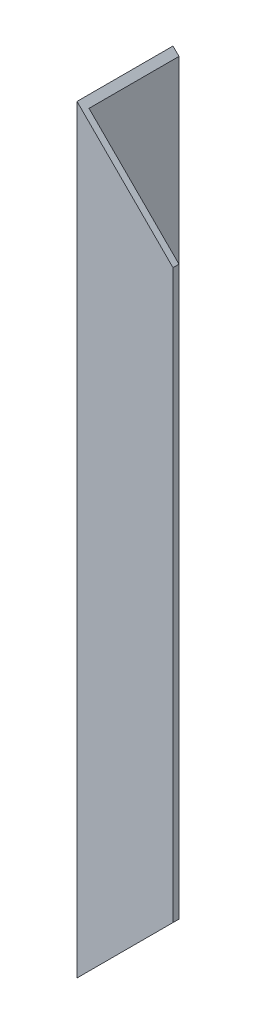
ISO-10303-21;
HEADER;
FILE_DESCRIPTION(('STEP AP214'),'2;1');
FILE_NAME('part.step','',(''),(''),'','','');
FILE_SCHEMA(('AUTOMOTIVE_DESIGN { 1 0 10303 214 1 1 1 1 }'));
ENDSEC;
DATA;
#1=APPLICATION_CONTEXT('core data for automotive mechanical design processes');
#2=APPLICATION_PROTOCOL_DEFINITION('international standard','automotive_design',2000,#1);
#3=PRODUCT_CONTEXT('',#1,'mechanical');
#4=PRODUCT('Part','Part','',(#3));
#5=PRODUCT_RELATED_PRODUCT_CATEGORY('part','',(#4));
#6=PRODUCT_DEFINITION_FORMATION('','',#4);
#7=PRODUCT_DEFINITION_CONTEXT('part definition',#1,'design');
#8=PRODUCT_DEFINITION('design','',#6,#7);
#9=PRODUCT_DEFINITION_SHAPE('','',#8);
#10=(LENGTH_UNIT() NAMED_UNIT(*) SI_UNIT(.MILLI.,.METRE.));
#11=(NAMED_UNIT(*) PLANE_ANGLE_UNIT() SI_UNIT($,.RADIAN.));
#12=(NAMED_UNIT(*) SI_UNIT($,.STERADIAN.) SOLID_ANGLE_UNIT());
#13=UNCERTAINTY_MEASURE_WITH_UNIT(LENGTH_MEASURE(1.E-05),#10,'distance_accuracy_value','');
#14=(GEOMETRIC_REPRESENTATION_CONTEXT(3) GLOBAL_UNCERTAINTY_ASSIGNED_CONTEXT((#13)) GLOBAL_UNIT_ASSIGNED_CONTEXT((#10,
#11,#12)) REPRESENTATION_CONTEXT('',''));
#15=CARTESIAN_POINT('',(0.,0.,0.));
#16=DIRECTION('',(0.,0.,1.));
#17=DIRECTION('',(1.,0.,0.));
#18=AXIS2_PLACEMENT_3D('',#15,#16,#17);
#19=CARTESIAN_POINT('',(25.4,200.914,0.));
#20=DIRECTION('',(0.,0.,-1.));
#21=DIRECTION('',(-1.,0.,0.));
#22=AXIS2_PLACEMENT_3D('',#19,#20,#21);
#23=PLANE('',#22);
#24=DIRECTION('',(0.,-1.,0.));
#25=VECTOR('',#24,1.);
#26=CARTESIAN_POINT('',(0.,200.914,0.));
#27=LINE('',#26,#25);
#28=CARTESIAN_POINT('',(0.,200.914,0.));
#29=VERTEX_POINT('',#28);
#30=CARTESIAN_POINT('',(0.,0.,0.));
#31=VERTEX_POINT('',#30);
#32=EDGE_CURVE('E106',#29,#31,#27,.T.);
#33=ORIENTED_EDGE('',*,*,#32,.T.);
#34=DIRECTION('',(-0.707106781186551,-0.707106781186544,0.));
#35=VECTOR('',#34,1.);
#36=CARTESIAN_POINT('',(0.,0.,0.));
#37=LINE('',#36,#35);
#38=CARTESIAN_POINT('',(25.4,25.3999999999997,0.));
#39=VERTEX_POINT('',#38);
#40=EDGE_CURVE('E88',#39,#31,#37,.T.);
#41=ORIENTED_EDGE('',*,*,#40,.F.);
#42=DIRECTION('',(0.,-1.,0.));
#43=VECTOR('',#42,1.);
#44=CARTESIAN_POINT('',(25.4,200.914,0.));
#45=LINE('',#44,#43);
#46=CARTESIAN_POINT('',(25.4,175.514,0.));
#47=VERTEX_POINT('',#46);
#48=EDGE_CURVE('E11',#47,#39,#45,.T.);
#49=ORIENTED_EDGE('',*,*,#48,.F.);
#50=DIRECTION('',(0.707106781186552,-0.707106781186543,0.));
#51=VECTOR('',#50,1.);
#52=CARTESIAN_POINT('',(0.,200.914,0.));
#53=LINE('',#52,#51);
#54=EDGE_CURVE('E133',#29,#47,#53,.T.);
#55=ORIENTED_EDGE('',*,*,#54,.F.);
#56=EDGE_LOOP('',(#33,#41,#49,#55));
#57=FACE_BOUND('',#56,.T.);
#58=ADVANCED_FACE('F35',(#57),#23,.F.);
#59=CARTESIAN_POINT('',(25.4,200.914,-1.5875));
#60=DIRECTION('',(-1.,0.,0.));
#61=DIRECTION('',(0.,0.,1.));
#62=AXIS2_PLACEMENT_3D('',#59,#60,#61);
#63=PLANE('',#62);
#64=ORIENTED_EDGE('',*,*,#48,.T.);
#65=DIRECTION('',(0.,0.,1.));
#66=VECTOR('',#65,1.);
#67=CARTESIAN_POINT('',(25.4,25.3999999999997,-25.4));
#68=LINE('',#67,#66);
#69=CARTESIAN_POINT('',(25.4,25.3999999999997,-1.5875));
#70=VERTEX_POINT('',#69);
#71=EDGE_CURVE('E103',#70,#39,#68,.T.);
#72=ORIENTED_EDGE('',*,*,#71,.F.);
#73=DIRECTION('',(0.,-1.,0.));
#74=VECTOR('',#73,1.);
#75=CARTESIAN_POINT('',(25.4,200.914,-1.5875));
#76=LINE('',#75,#74);
#77=CARTESIAN_POINT('',(25.4,175.514,-1.5875));
#78=VERTEX_POINT('',#77);
#79=EDGE_CURVE('E43',#78,#70,#76,.T.);
#80=ORIENTED_EDGE('',*,*,#79,.F.);
#81=DIRECTION('',(0.,0.,1.));
#82=VECTOR('',#81,1.);
#83=CARTESIAN_POINT('',(25.4,175.514,-25.4));
#84=LINE('',#83,#82);
#85=EDGE_CURVE('E125',#78,#47,#84,.T.);
#86=ORIENTED_EDGE('',*,*,#85,.T.);
#87=EDGE_LOOP('',(#64,#72,#80,#86));
#88=FACE_BOUND('',#87,.T.);
#89=ADVANCED_FACE('F124',(#88),#63,.F.);
#90=CARTESIAN_POINT('',(1.5875,200.914,-1.5875));
#91=DIRECTION('',(0.,0.,1.));
#92=DIRECTION('',(1.,0.,0.));
#93=AXIS2_PLACEMENT_3D('',#90,#91,#92);
#94=PLANE('',#93);
#95=ORIENTED_EDGE('',*,*,#79,.T.);
#96=DIRECTION('',(-0.707106781186551,-0.707106781186544,0.));
#97=VECTOR('',#96,1.);
#98=CARTESIAN_POINT('',(101.25075,101.250749999999,-1.5875));
#99=LINE('',#98,#97);
#100=CARTESIAN_POINT('',(1.5875,1.5875,-1.5875));
#101=VERTEX_POINT('',#100);
#102=EDGE_CURVE('E120',#70,#101,#99,.T.);
#103=ORIENTED_EDGE('',*,*,#102,.T.);
#104=DIRECTION('',(0.,-1.,0.));
#105=VECTOR('',#104,1.);
#106=CARTESIAN_POINT('',(1.5875,200.914,-1.5875));
#107=LINE('',#106,#105);
#108=CARTESIAN_POINT('',(1.5875,199.3265,-1.5875));
#109=VERTEX_POINT('',#108);
#110=EDGE_CURVE('E108',#109,#101,#107,.T.);
#111=ORIENTED_EDGE('',*,*,#110,.F.);
#112=DIRECTION('',(0.707106781186552,-0.707106781186543,0.));
#113=VECTOR('',#112,1.);
#114=CARTESIAN_POINT('',(0.793750000000011,200.12025,-1.5875));
#115=LINE('',#114,#113);
#116=EDGE_CURVE('E94',#109,#78,#115,.T.);
#117=ORIENTED_EDGE('',*,*,#116,.T.);
#118=EDGE_LOOP('',(#95,#103,#111,#117));
#119=FACE_BOUND('',#118,.T.);
#120=ADVANCED_FACE('F118',(#119),#94,.F.);
#121=CARTESIAN_POINT('',(1.5875,200.914,-25.4));
#122=DIRECTION('',(-1.,0.,0.));
#123=DIRECTION('',(0.,0.,1.));
#124=AXIS2_PLACEMENT_3D('',#121,#122,#123);
#125=PLANE('',#124);
#126=ORIENTED_EDGE('',*,*,#110,.T.);
#127=DIRECTION('',(0.,0.,-1.));
#128=VECTOR('',#127,1.);
#129=CARTESIAN_POINT('',(1.5875,1.58749999999999,-25.4));
#130=LINE('',#129,#128);
#131=CARTESIAN_POINT('',(1.58750000000001,1.5875,-25.4));
#132=VERTEX_POINT('',#131);
#133=EDGE_CURVE('E127',#101,#132,#130,.T.);
#134=ORIENTED_EDGE('',*,*,#133,.T.);
#135=DIRECTION('',(0.,-1.,0.));
#136=VECTOR('',#135,1.);
#137=CARTESIAN_POINT('',(1.5875,200.914,-25.4));
#138=LINE('',#137,#136);
#139=CARTESIAN_POINT('',(1.58750000000001,199.3265,-25.4));
#140=VERTEX_POINT('',#139);
#141=EDGE_CURVE('E102',#140,#132,#138,.T.);
#142=ORIENTED_EDGE('',*,*,#141,.F.);
#143=DIRECTION('',(0.,0.,1.));
#144=VECTOR('',#143,1.);
#145=CARTESIAN_POINT('',(1.5875,199.3265,-25.4));
#146=LINE('',#145,#144);
#147=EDGE_CURVE('E137',#140,#109,#146,.T.);
#148=ORIENTED_EDGE('',*,*,#147,.T.);
#149=EDGE_LOOP('',(#126,#134,#142,#148));
#150=FACE_BOUND('',#149,.T.);
#151=ADVANCED_FACE('F151',(#150),#125,.F.);
#152=CARTESIAN_POINT('',(0.,200.914,-25.4));
#153=DIRECTION('',(0.,0.,1.));
#154=DIRECTION('',(1.,0.,0.));
#155=AXIS2_PLACEMENT_3D('',#152,#153,#154);
#156=PLANE('',#155);
#157=ORIENTED_EDGE('',*,*,#141,.T.);
#158=DIRECTION('',(-0.707106781186551,-0.707106781186544,0.));
#159=VECTOR('',#158,1.);
#160=CARTESIAN_POINT('',(0.,0.,-25.4));
#161=LINE('',#160,#159);
#162=CARTESIAN_POINT('',(0.,0.,-25.4));
#163=VERTEX_POINT('',#162);
#164=EDGE_CURVE('E85',#132,#163,#161,.T.);
#165=ORIENTED_EDGE('',*,*,#164,.T.);
#166=DIRECTION('',(0.,-1.,0.));
#167=VECTOR('',#166,1.);
#168=CARTESIAN_POINT('',(0.,200.914,-25.4));
#169=LINE('',#168,#167);
#170=CARTESIAN_POINT('',(0.,200.914,-25.4));
#171=VERTEX_POINT('',#170);
#172=EDGE_CURVE('E99',#171,#163,#169,.T.);
#173=ORIENTED_EDGE('',*,*,#172,.F.);
#174=DIRECTION('',(0.707106781186552,-0.707106781186543,0.));
#175=VECTOR('',#174,1.);
#176=CARTESIAN_POINT('',(0.,200.914,-25.4));
#177=LINE('',#176,#175);
#178=EDGE_CURVE('E49',#171,#140,#177,.T.);
#179=ORIENTED_EDGE('',*,*,#178,.T.);
#180=EDGE_LOOP('',(#157,#165,#173,#179));
#181=FACE_BOUND('',#180,.T.);
#182=ADVANCED_FACE('F98',(#181),#156,.F.);
#183=CARTESIAN_POINT('',(0.,200.914,0.));
#184=DIRECTION('',(1.,0.,0.));
#185=DIRECTION('',(0.,0.,-1.));
#186=AXIS2_PLACEMENT_3D('',#183,#184,#185);
#187=PLANE('',#186);
#188=DIRECTION('',(0.,0.,1.));
#189=VECTOR('',#188,1.);
#190=CARTESIAN_POINT('',(0.,0.,0.));
#191=LINE('',#190,#189);
#192=EDGE_CURVE('E82',#163,#31,#191,.T.);
#193=ORIENTED_EDGE('',*,*,#192,.T.);
#194=ORIENTED_EDGE('',*,*,#32,.F.);
#195=DIRECTION('',(0.,0.,1.));
#196=VECTOR('',#195,1.);
#197=CARTESIAN_POINT('',(0.,200.914,0.));
#198=LINE('',#197,#196);
#199=EDGE_CURVE('E93',#171,#29,#198,.T.);
#200=ORIENTED_EDGE('',*,*,#199,.F.);
#201=ORIENTED_EDGE('',*,*,#172,.T.);
#202=EDGE_LOOP('',(#193,#194,#200,#201));
#203=FACE_BOUND('',#202,.T.);
#204=ADVANCED_FACE('F105',(#203),#187,.F.);
#205=CARTESIAN_POINT('',(0.,200.914,-25.4));
#206=DIRECTION('',(-0.707106781186543,-0.707106781186552,0.));
#207=DIRECTION('',(0.707106781186552,-0.707106781186543,0.));
#208=AXIS2_PLACEMENT_3D('',#205,#206,#207);
#209=PLANE('',#208);
#210=ORIENTED_EDGE('',*,*,#147,.F.);
#211=ORIENTED_EDGE('',*,*,#178,.F.);
#212=ORIENTED_EDGE('',*,*,#199,.T.);
#213=ORIENTED_EDGE('',*,*,#54,.T.);
#214=ORIENTED_EDGE('',*,*,#85,.F.);
#215=ORIENTED_EDGE('',*,*,#116,.F.);
#216=EDGE_LOOP('',(#210,#211,#212,#213,#214,#215));
#217=FACE_BOUND('',#216,.T.);
#218=ADVANCED_FACE('F142',(#217),#209,.F.);
#219=CARTESIAN_POINT('',(0.,0.,-25.4));
#220=DIRECTION('',(-0.707106781186544,0.707106781186551,0.));
#221=DIRECTION('',(-0.707106781186551,-0.707106781186544,0.));
#222=AXIS2_PLACEMENT_3D('',#219,#220,#221);
#223=PLANE('',#222);
#224=ORIENTED_EDGE('',*,*,#71,.T.);
#225=ORIENTED_EDGE('',*,*,#40,.T.);
#226=ORIENTED_EDGE('',*,*,#192,.F.);
#227=ORIENTED_EDGE('',*,*,#164,.F.);
#228=ORIENTED_EDGE('',*,*,#133,.F.);
#229=ORIENTED_EDGE('',*,*,#102,.F.);
#230=EDGE_LOOP('',(#224,#225,#226,#227,#228,#229));
#231=FACE_BOUND('',#230,.T.);
#232=ADVANCED_FACE('F84',(#231),#223,.F.);
#233=CLOSED_SHELL('',(#58,#89,#120,#151,#182,#204,#218,#232));
#234=MANIFOLD_SOLID_BREP('B2',#233);
#235=ADVANCED_BREP_SHAPE_REPRESENTATION('',(#18,#234),#14);
#236=SHAPE_DEFINITION_REPRESENTATION(#9,#235);
ENDSEC;
END-ISO-10303-21;
